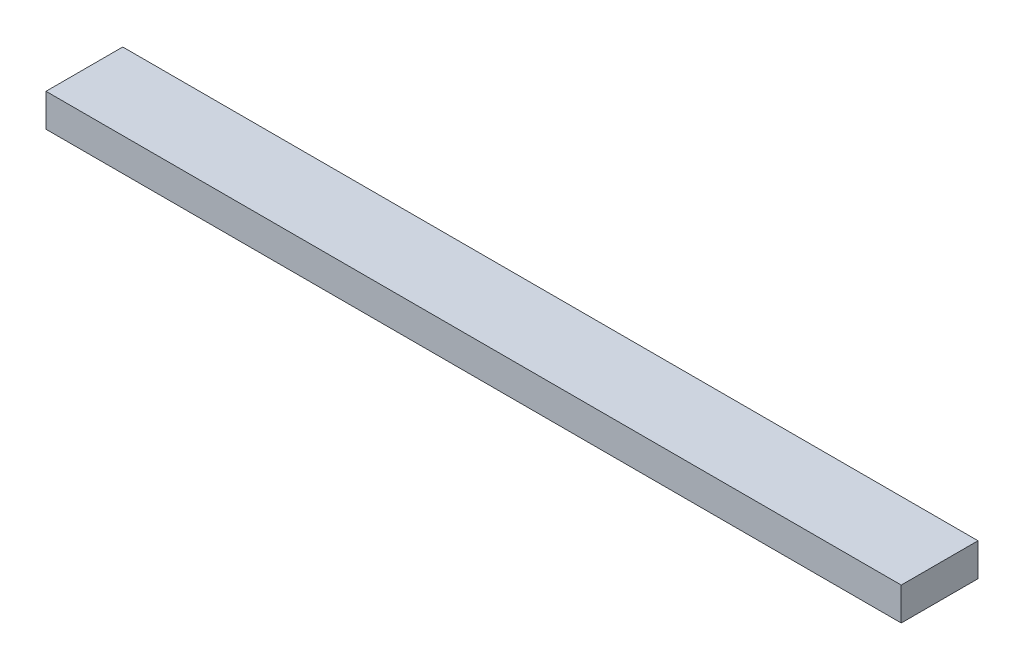
ISO-10303-21;
HEADER;
FILE_DESCRIPTION(('STEP AP214'),'2;1');
FILE_NAME('part.step','',(''),(''),'','','');
FILE_SCHEMA(('AUTOMOTIVE_DESIGN { 1 0 10303 214 1 1 1 1 }'));
ENDSEC;
DATA;
#1=APPLICATION_CONTEXT('core data for automotive mechanical design processes');
#2=APPLICATION_PROTOCOL_DEFINITION('international standard','automotive_design',2000,#1);
#3=PRODUCT_CONTEXT('',#1,'mechanical');
#4=PRODUCT('Part','Part','',(#3));
#5=PRODUCT_RELATED_PRODUCT_CATEGORY('part','',(#4));
#6=PRODUCT_DEFINITION_FORMATION('','',#4);
#7=PRODUCT_DEFINITION_CONTEXT('part definition',#1,'design');
#8=PRODUCT_DEFINITION('design','',#6,#7);
#9=PRODUCT_DEFINITION_SHAPE('','',#8);
#10=(LENGTH_UNIT() NAMED_UNIT(*) SI_UNIT(.MILLI.,.METRE.));
#11=(NAMED_UNIT(*) PLANE_ANGLE_UNIT() SI_UNIT($,.RADIAN.));
#12=(NAMED_UNIT(*) SI_UNIT($,.STERADIAN.) SOLID_ANGLE_UNIT());
#13=UNCERTAINTY_MEASURE_WITH_UNIT(LENGTH_MEASURE(1.E-05),#10,'distance_accuracy_value','');
#14=(GEOMETRIC_REPRESENTATION_CONTEXT(3) GLOBAL_UNCERTAINTY_ASSIGNED_CONTEXT((#13)) GLOBAL_UNIT_ASSIGNED_CONTEXT((#10,
#11,#12)) REPRESENTATION_CONTEXT('',''));
#15=CARTESIAN_POINT('',(0.,0.,0.));
#16=DIRECTION('',(0.,0.,1.));
#17=DIRECTION('',(1.,0.,0.));
#18=AXIS2_PLACEMENT_3D('',#15,#16,#17);
#19=CARTESIAN_POINT('',(0.,38.1,0.));
#20=DIRECTION('',(1.,0.,0.));
#21=DIRECTION('',(0.,0.,-1.));
#22=AXIS2_PLACEMENT_3D('',#19,#20,#21);
#23=PLANE('',#22);
#24=DIRECTION('',(0.,0.,1.));
#25=VECTOR('',#24,1.);
#26=CARTESIAN_POINT('',(0.,0.,0.));
#27=LINE('',#26,#25);
#28=CARTESIAN_POINT('',(0.,0.,-88.9));
#29=VERTEX_POINT('',#28);
#30=CARTESIAN_POINT('',(0.,0.,0.));
#31=VERTEX_POINT('',#30);
#32=EDGE_CURVE('E102',#29,#31,#27,.T.);
#33=ORIENTED_EDGE('',*,*,#32,.T.);
#34=DIRECTION('',(0.,-1.,0.));
#35=VECTOR('',#34,1.);
#36=CARTESIAN_POINT('',(0.,38.1,0.));
#37=LINE('',#36,#35);
#38=CARTESIAN_POINT('',(0.,38.1,0.));
#39=VERTEX_POINT('',#38);
#40=EDGE_CURVE('E11',#39,#31,#37,.T.);
#41=ORIENTED_EDGE('',*,*,#40,.F.);
#42=DIRECTION('',(0.,0.,1.));
#43=VECTOR('',#42,1.);
#44=CARTESIAN_POINT('',(0.,38.1,0.));
#45=LINE('',#44,#43);
#46=CARTESIAN_POINT('',(0.,38.1,-88.9));
#47=VERTEX_POINT('',#46);
#48=EDGE_CURVE('E90',#47,#39,#45,.T.);
#49=ORIENTED_EDGE('',*,*,#48,.F.);
#50=DIRECTION('',(0.,-1.,0.));
#51=VECTOR('',#50,1.);
#52=CARTESIAN_POINT('',(0.,38.1,-88.9));
#53=LINE('',#52,#51);
#54=EDGE_CURVE('E98',#47,#29,#53,.T.);
#55=ORIENTED_EDGE('',*,*,#54,.T.);
#56=EDGE_LOOP('',(#33,#41,#49,#55));
#57=FACE_BOUND('',#56,.T.);
#58=ADVANCED_FACE('F39',(#57),#23,.F.);
#59=CARTESIAN_POINT('',(0.,38.1,0.));
#60=DIRECTION('',(0.,0.,-1.));
#61=DIRECTION('',(-1.,0.,0.));
#62=AXIS2_PLACEMENT_3D('',#59,#60,#61);
#63=PLANE('',#62);
#64=DIRECTION('',(1.,0.,0.));
#65=VECTOR('',#64,1.);
#66=CARTESIAN_POINT('',(0.,0.,0.));
#67=LINE('',#66,#65);
#68=CARTESIAN_POINT('',(990.6,0.,0.));
#69=VERTEX_POINT('',#68);
#70=EDGE_CURVE('E94',#31,#69,#67,.T.);
#71=ORIENTED_EDGE('',*,*,#70,.T.);
#72=DIRECTION('',(0.,-1.,0.));
#73=VECTOR('',#72,1.);
#74=CARTESIAN_POINT('',(990.6,38.1,0.));
#75=LINE('',#74,#73);
#76=CARTESIAN_POINT('',(990.6,38.1,0.));
#77=VERTEX_POINT('',#76);
#78=EDGE_CURVE('E47',#77,#69,#75,.T.);
#79=ORIENTED_EDGE('',*,*,#78,.F.);
#80=DIRECTION('',(1.,0.,0.));
#81=VECTOR('',#80,1.);
#82=CARTESIAN_POINT('',(0.,38.1,0.));
#83=LINE('',#82,#81);
#84=EDGE_CURVE('E85',#39,#77,#83,.T.);
#85=ORIENTED_EDGE('',*,*,#84,.F.);
#86=ORIENTED_EDGE('',*,*,#40,.T.);
#87=EDGE_LOOP('',(#71,#79,#85,#86));
#88=FACE_BOUND('',#87,.T.);
#89=ADVANCED_FACE('F93',(#88),#63,.F.);
#90=CARTESIAN_POINT('',(990.6,38.1,0.));
#91=DIRECTION('',(-1.,0.,0.));
#92=DIRECTION('',(0.,0.,1.));
#93=AXIS2_PLACEMENT_3D('',#90,#91,#92);
#94=PLANE('',#93);
#95=DIRECTION('',(0.,0.,-1.));
#96=VECTOR('',#95,1.);
#97=CARTESIAN_POINT('',(990.6,0.,0.));
#98=LINE('',#97,#96);
#99=CARTESIAN_POINT('',(990.6,0.,-88.9));
#100=VERTEX_POINT('',#99);
#101=EDGE_CURVE('E72',#69,#100,#98,.T.);
#102=ORIENTED_EDGE('',*,*,#101,.T.);
#103=DIRECTION('',(0.,-1.,0.));
#104=VECTOR('',#103,1.);
#105=CARTESIAN_POINT('',(990.6,38.1,-88.9));
#106=LINE('',#105,#104);
#107=CARTESIAN_POINT('',(990.6,38.1,-88.9));
#108=VERTEX_POINT('',#107);
#109=EDGE_CURVE('E95',#108,#100,#106,.T.);
#110=ORIENTED_EDGE('',*,*,#109,.F.);
#111=DIRECTION('',(0.,0.,-1.));
#112=VECTOR('',#111,1.);
#113=CARTESIAN_POINT('',(990.6,38.1,0.));
#114=LINE('',#113,#112);
#115=EDGE_CURVE('E88',#77,#108,#114,.T.);
#116=ORIENTED_EDGE('',*,*,#115,.F.);
#117=ORIENTED_EDGE('',*,*,#78,.T.);
#118=EDGE_LOOP('',(#102,#110,#116,#117));
#119=FACE_BOUND('',#118,.T.);
#120=ADVANCED_FACE('F96',(#119),#94,.F.);
#121=CARTESIAN_POINT('',(0.,38.1,-88.9));
#122=DIRECTION('',(0.,0.,1.));
#123=DIRECTION('',(1.,0.,0.));
#124=AXIS2_PLACEMENT_3D('',#121,#122,#123);
#125=PLANE('',#124);
#126=DIRECTION('',(-1.,0.,0.));
#127=VECTOR('',#126,1.);
#128=CARTESIAN_POINT('',(0.,0.,-88.9));
#129=LINE('',#128,#127);
#130=EDGE_CURVE('E78',#100,#29,#129,.T.);
#131=ORIENTED_EDGE('',*,*,#130,.T.);
#132=ORIENTED_EDGE('',*,*,#54,.F.);
#133=DIRECTION('',(-1.,0.,0.));
#134=VECTOR('',#133,1.);
#135=CARTESIAN_POINT('',(0.,38.1,-88.9));
#136=LINE('',#135,#134);
#137=EDGE_CURVE('E55',#108,#47,#136,.T.);
#138=ORIENTED_EDGE('',*,*,#137,.F.);
#139=ORIENTED_EDGE('',*,*,#109,.T.);
#140=EDGE_LOOP('',(#131,#132,#138,#139));
#141=FACE_BOUND('',#140,.T.);
#142=ADVANCED_FACE('F109',(#141),#125,.F.);
#143=CARTESIAN_POINT('',(0.,38.1,0.));
#144=DIRECTION('',(0.,-1.,0.));
#145=DIRECTION('',(0.,0.,-1.));
#146=AXIS2_PLACEMENT_3D('',#143,#144,#145);
#147=PLANE('',#146);
#148=ORIENTED_EDGE('',*,*,#48,.T.);
#149=ORIENTED_EDGE('',*,*,#84,.T.);
#150=ORIENTED_EDGE('',*,*,#115,.T.);
#151=ORIENTED_EDGE('',*,*,#137,.T.);
#152=EDGE_LOOP('',(#148,#149,#150,#151));
#153=FACE_BOUND('',#152,.T.);
#154=ADVANCED_FACE('F86',(#153),#147,.F.);
#155=CARTESIAN_POINT('',(0.,0.,0.));
#156=DIRECTION('',(0.,-1.,0.));
#157=DIRECTION('',(0.,0.,-1.));
#158=AXIS2_PLACEMENT_3D('',#155,#156,#157);
#159=PLANE('',#158);
#160=ORIENTED_EDGE('',*,*,#32,.F.);
#161=ORIENTED_EDGE('',*,*,#130,.F.);
#162=ORIENTED_EDGE('',*,*,#101,.F.);
#163=ORIENTED_EDGE('',*,*,#70,.F.);
#164=EDGE_LOOP('',(#160,#161,#162,#163));
#165=FACE_BOUND('',#164,.T.);
#166=ADVANCED_FACE('F112',(#165),#159,.T.);
#167=CLOSED_SHELL('',(#58,#89,#120,#142,#154,#166));
#168=MANIFOLD_SOLID_BREP('B2',#167);
#169=ADVANCED_BREP_SHAPE_REPRESENTATION('',(#18,#168),#14);
#170=SHAPE_DEFINITION_REPRESENTATION(#9,#169);
ENDSEC;
END-ISO-10303-21;
